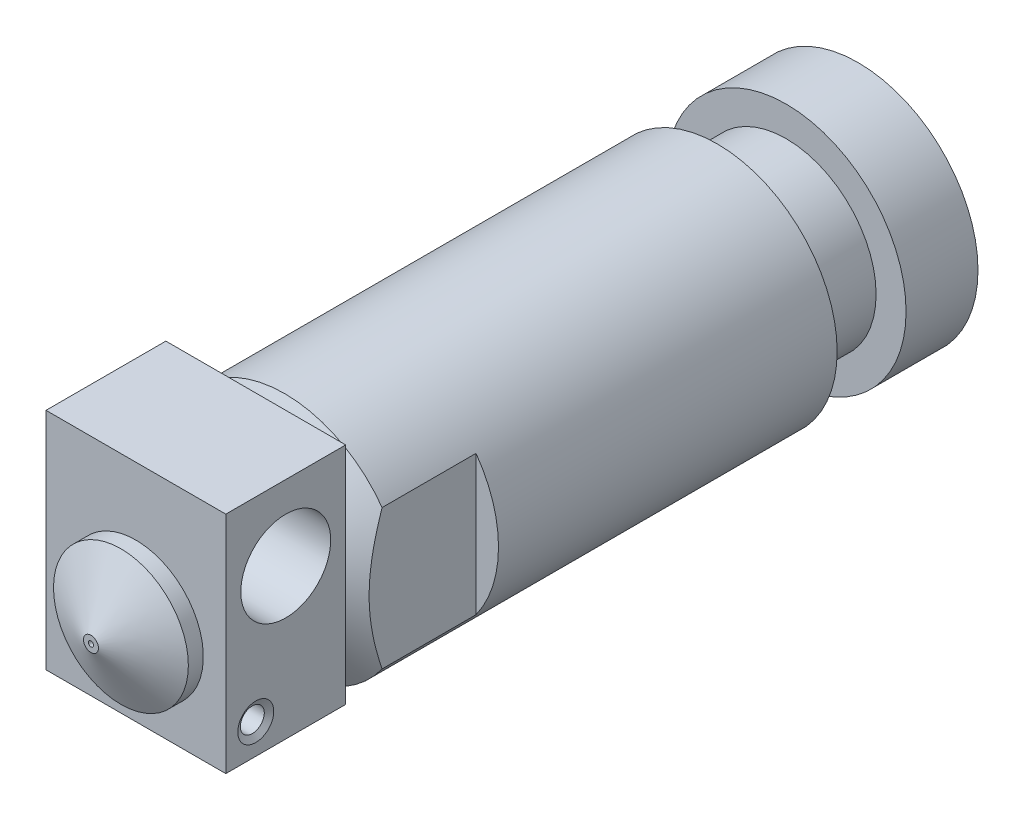
ISO-10303-21;
HEADER;
FILE_DESCRIPTION(('STEP AP214'),'2;1');
FILE_NAME('part.step','',(''),(''),'','','');
FILE_SCHEMA(('AUTOMOTIVE_DESIGN { 1 0 10303 214 1 1 1 1 }'));
ENDSEC;
DATA;
#1=APPLICATION_CONTEXT('core data for automotive mechanical design processes');
#2=APPLICATION_PROTOCOL_DEFINITION('international standard','automotive_design',2000,#1);
#3=PRODUCT_CONTEXT('',#1,'mechanical');
#4=PRODUCT('Part','Part','',(#3));
#5=PRODUCT_RELATED_PRODUCT_CATEGORY('part','',(#4));
#6=PRODUCT_DEFINITION_FORMATION('','',#4);
#7=PRODUCT_DEFINITION_CONTEXT('part definition',#1,'design');
#8=PRODUCT_DEFINITION('design','',#6,#7);
#9=PRODUCT_DEFINITION_SHAPE('','',#8);
#10=(LENGTH_UNIT() NAMED_UNIT(*) SI_UNIT(.MILLI.,.METRE.));
#11=(NAMED_UNIT(*) PLANE_ANGLE_UNIT() SI_UNIT($,.RADIAN.));
#12=(NAMED_UNIT(*) SI_UNIT($,.STERADIAN.) SOLID_ANGLE_UNIT());
#13=UNCERTAINTY_MEASURE_WITH_UNIT(LENGTH_MEASURE(1.E-05),#10,'distance_accuracy_value','');
#14=(GEOMETRIC_REPRESENTATION_CONTEXT(3) GLOBAL_UNCERTAINTY_ASSIGNED_CONTEXT((#13)) GLOBAL_UNIT_ASSIGNED_CONTEXT((#10,
#11,#12)) REPRESENTATION_CONTEXT('',''));
#15=CARTESIAN_POINT('',(0.,0.,0.));
#16=DIRECTION('',(0.,0.,1.));
#17=DIRECTION('',(1.,0.,0.));
#18=AXIS2_PLACEMENT_3D('',#15,#16,#17);
#19=CARTESIAN_POINT('',(0.,0.,48.2));
#20=DIRECTION('',(0.,0.,-1.));
#21=DIRECTION('',(-1.,0.,0.));
#22=AXIS2_PLACEMENT_3D('',#19,#20,#21);
#23=PLANE('',#22);
#24=DIRECTION('',(0.,1.,0.));
#25=VECTOR('',#24,1.);
#26=CARTESIAN_POINT('',(6.,9.,48.2));
#27=LINE('',#26,#25);
#28=CARTESIAN_POINT('',(6.,-6.,48.2));
#29=VERTEX_POINT('',#28);
#30=CARTESIAN_POINT('',(6.,9.,48.2));
#31=VERTEX_POINT('',#30);
#32=EDGE_CURVE('E116',#29,#31,#27,.T.);
#33=ORIENTED_EDGE('',*,*,#32,.T.);
#34=DIRECTION('',(-1.,0.,0.));
#35=VECTOR('',#34,1.);
#36=CARTESIAN_POINT('',(6.,9.,48.2));
#37=LINE('',#36,#35);
#38=CARTESIAN_POINT('',(-6.,9.,48.2));
#39=VERTEX_POINT('',#38);
#40=EDGE_CURVE('E105',#31,#39,#37,.T.);
#41=ORIENTED_EDGE('',*,*,#40,.T.);
#42=DIRECTION('',(0.,-1.,0.));
#43=VECTOR('',#42,1.);
#44=CARTESIAN_POINT('',(-6.,9.,48.2));
#45=LINE('',#44,#43);
#46=CARTESIAN_POINT('',(-6.,-6.,48.2));
#47=VERTEX_POINT('',#46);
#48=EDGE_CURVE('E115',#39,#47,#45,.T.);
#49=ORIENTED_EDGE('',*,*,#48,.T.);
#50=DIRECTION('',(1.,0.,0.));
#51=VECTOR('',#50,1.);
#52=CARTESIAN_POINT('',(6.,-6.,48.2));
#53=LINE('',#52,#51);
#54=EDGE_CURVE('E121',#47,#29,#53,.T.);
#55=ORIENTED_EDGE('',*,*,#54,.T.);
#56=EDGE_LOOP('',(#33,#41,#49,#55));
#57=FACE_BOUND('',#56,.T.);
#58=CARTESIAN_POINT('',(0.,0.,48.2));
#59=DIRECTION('',(0.,0.,-1.));
#60=DIRECTION('',(-1.,0.,0.));
#61=AXIS2_PLACEMENT_3D('',#58,#59,#60);
#62=CIRCLE('',#61,4.5);
#63=CARTESIAN_POINT('',(-4.5,0.,48.2));
#64=VERTEX_POINT('',#63);
#65=EDGE_CURVE('E316',#64,#64,#62,.F.);
#66=ORIENTED_EDGE('',*,*,#65,.F.);
#67=EDGE_LOOP('',(#66));
#68=FACE_BOUND('',#67,.T.);
#69=ADVANCED_FACE('F37',(#57,#68),#23,.F.);
#70=CARTESIAN_POINT('',(0.,0.,40.));
#71=DIRECTION('',(0.,0.,1.));
#72=DIRECTION('',(1.,0.,0.));
#73=AXIS2_PLACEMENT_3D('',#70,#71,#72);
#74=PLANE('',#73);
#75=CARTESIAN_POINT('',(0.,0.,40.));
#76=DIRECTION('',(0.,0.,1.));
#77=DIRECTION('',(1.,0.,0.));
#78=AXIS2_PLACEMENT_3D('',#75,#76,#77);
#79=CIRCLE('',#78,4.99999999999996);
#80=CARTESIAN_POINT('',(4.99999999999996,0.,40.));
#81=VERTEX_POINT('',#80);
#82=EDGE_CURVE('E176',#81,#81,#79,.T.);
#83=ORIENTED_EDGE('',*,*,#82,.T.);
#84=EDGE_LOOP('',(#83));
#85=FACE_BOUND('',#84,.T.);
#86=CARTESIAN_POINT('',(0.,0.,40.));
#87=DIRECTION('',(0.,0.,1.));
#88=DIRECTION('',(1.,0.,0.));
#89=AXIS2_PLACEMENT_3D('',#86,#87,#88);
#90=CIRCLE('',#89,4.);
#91=CARTESIAN_POINT('',(4.,0.,40.));
#92=VERTEX_POINT('',#91);
#93=EDGE_CURVE('E130',#92,#92,#90,.T.);
#94=ORIENTED_EDGE('',*,*,#93,.F.);
#95=EDGE_LOOP('',(#94));
#96=FACE_BOUND('',#95,.T.);
#97=ADVANCED_FACE('F217',(#85,#96),#74,.T.);
#98=CARTESIAN_POINT('',(0.,0.,40.));
#99=DIRECTION('',(0.,0.,-1.));
#100=DIRECTION('',(-1.,0.,0.));
#101=AXIS2_PLACEMENT_3D('',#98,#99,#100);
#102=CYLINDRICAL_SURFACE('',#101,8.);
#103=CARTESIAN_POINT('',(0.,0.,38.2679491924311));
#104=DIRECTION('',(0.,0.,1.));
#105=DIRECTION('',(1.,0.,0.));
#106=AXIS2_PLACEMENT_3D('',#103,#104,#105);
#107=CIRCLE('',#106,8.);
#108=CARTESIAN_POINT('',(-6.5,4.66368952654441,38.2679491924311));
#109=VERTEX_POINT('',#108);
#110=CARTESIAN_POINT('',(6.5,4.66368952654441,38.2679491924311));
#111=VERTEX_POINT('',#110);
#112=EDGE_CURVE('E179',#109,#111,#107,.F.);
#113=ORIENTED_EDGE('',*,*,#112,.T.);
#114=DIRECTION('',(0.,0.,-1.));
#115=VECTOR('',#114,1.);
#116=CARTESIAN_POINT('',(6.5,4.66368952654441,40.));
#117=LINE('',#116,#115);
#118=CARTESIAN_POINT('',(6.5,4.66368952654441,32.));
#119=VERTEX_POINT('',#118);
#120=EDGE_CURVE('E52',#111,#119,#117,.T.);
#121=ORIENTED_EDGE('',*,*,#120,.T.);
#122=CARTESIAN_POINT('',(0.,0.,32.));
#123=DIRECTION('',(0.,0.,-1.));
#124=DIRECTION('',(-1.,0.,0.));
#125=AXIS2_PLACEMENT_3D('',#122,#123,#124);
#126=CIRCLE('',#125,8.);
#127=CARTESIAN_POINT('',(6.5,-4.66368952654441,32.));
#128=VERTEX_POINT('',#127);
#129=EDGE_CURVE('E303',#119,#128,#126,.T.);
#130=ORIENTED_EDGE('',*,*,#129,.T.);
#131=DIRECTION('',(0.,0.,-1.));
#132=VECTOR('',#131,1.);
#133=CARTESIAN_POINT('',(6.5,-4.66368952654441,40.));
#134=LINE('',#133,#132);
#135=CARTESIAN_POINT('',(6.5,-4.66368952654441,38.2679491924311));
#136=VERTEX_POINT('',#135);
#137=EDGE_CURVE('E150',#128,#136,#134,.F.);
#138=ORIENTED_EDGE('',*,*,#137,.T.);
#139=CARTESIAN_POINT('',(-6.5,-4.66368952654441,38.2679491924311));
#140=VERTEX_POINT('',#139);
#141=EDGE_CURVE('E60',#136,#140,#107,.F.);
#142=ORIENTED_EDGE('',*,*,#141,.T.);
#143=DIRECTION('',(0.,0.,-1.));
#144=VECTOR('',#143,1.);
#145=CARTESIAN_POINT('',(-6.5,-4.66368952654441,40.));
#146=LINE('',#145,#144);
#147=CARTESIAN_POINT('',(-6.5,-4.66368952654441,32.));
#148=VERTEX_POINT('',#147);
#149=EDGE_CURVE('E159',#140,#148,#146,.T.);
#150=ORIENTED_EDGE('',*,*,#149,.T.);
#151=CARTESIAN_POINT('',(0.,0.,32.));
#152=DIRECTION('',(0.,0.,1.));
#153=DIRECTION('',(1.,0.,0.));
#154=AXIS2_PLACEMENT_3D('',#151,#152,#153);
#155=CIRCLE('',#154,8.);
#156=CARTESIAN_POINT('',(-6.5,4.66368952654441,32.));
#157=VERTEX_POINT('',#156);
#158=EDGE_CURVE('E189',#157,#148,#155,.T.);
#159=ORIENTED_EDGE('',*,*,#158,.F.);
#160=DIRECTION('',(0.,0.,-1.));
#161=VECTOR('',#160,1.);
#162=CARTESIAN_POINT('',(-6.5,4.66368952654441,40.));
#163=LINE('',#162,#161);
#164=EDGE_CURVE('E156',#157,#109,#163,.F.);
#165=ORIENTED_EDGE('',*,*,#164,.T.);
#166=EDGE_LOOP('',(#113,#121,#130,#138,#142,#150,#159,#165));
#167=FACE_BOUND('',#166,.T.);
#168=CARTESIAN_POINT('',(0.,0.,9.4));
#169=DIRECTION('',(0.,0.,-1.));
#170=DIRECTION('',(-1.,0.,0.));
#171=AXIS2_PLACEMENT_3D('',#168,#169,#170);
#172=CIRCLE('',#171,8.);
#173=CARTESIAN_POINT('',(-8.,0.,9.4));
#174=VERTEX_POINT('',#173);
#175=EDGE_CURVE('E168',#174,#174,#172,.T.);
#176=ORIENTED_EDGE('',*,*,#175,.F.);
#177=EDGE_LOOP('',(#176));
#178=FACE_BOUND('',#177,.T.);
#179=ADVANCED_FACE('F212',(#167,#178),#102,.T.);
#180=CARTESIAN_POINT('',(0.,0.,9.4));
#181=DIRECTION('',(0.,0.,-1.));
#182=DIRECTION('',(-1.,0.,0.));
#183=AXIS2_PLACEMENT_3D('',#180,#181,#182);
#184=PLANE('',#183);
#185=CARTESIAN_POINT('',(0.,0.,9.4));
#186=DIRECTION('',(0.,0.,-1.));
#187=DIRECTION('',(-1.,0.,0.));
#188=AXIS2_PLACEMENT_3D('',#185,#186,#187);
#189=CIRCLE('',#188,6.);
#190=CARTESIAN_POINT('',(-6.,0.,9.4));
#191=VERTEX_POINT('',#190);
#192=EDGE_CURVE('E162',#191,#191,#189,.T.);
#193=ORIENTED_EDGE('',*,*,#192,.F.);
#194=EDGE_LOOP('',(#193));
#195=FACE_BOUND('',#194,.T.);
#196=ORIENTED_EDGE('',*,*,#175,.T.);
#197=EDGE_LOOP('',(#196));
#198=FACE_BOUND('',#197,.T.);
#199=ADVANCED_FACE('F209',(#195,#198),#184,.T.);
#200=CARTESIAN_POINT('',(0.,0.,4.8));
#201=DIRECTION('',(0.,0.,-1.));
#202=DIRECTION('',(-1.,0.,0.));
#203=AXIS2_PLACEMENT_3D('',#200,#201,#202);
#204=PLANE('',#203);
#205=CARTESIAN_POINT('',(0.,0.,4.8));
#206=DIRECTION('',(0.,0.,-1.));
#207=DIRECTION('',(-1.,0.,0.));
#208=AXIS2_PLACEMENT_3D('',#205,#206,#207);
#209=CIRCLE('',#208,6.);
#210=CARTESIAN_POINT('',(-6.,0.,4.8));
#211=VERTEX_POINT('',#210);
#212=EDGE_CURVE('E161',#211,#211,#209,.T.);
#213=ORIENTED_EDGE('',*,*,#212,.T.);
#214=EDGE_LOOP('',(#213));
#215=FACE_BOUND('',#214,.T.);
#216=CARTESIAN_POINT('',(0.,0.,4.8));
#217=DIRECTION('',(0.,0.,-1.));
#218=DIRECTION('',(-1.,0.,0.));
#219=AXIS2_PLACEMENT_3D('',#216,#217,#218);
#220=CIRCLE('',#219,8.);
#221=CARTESIAN_POINT('',(-8.,0.,4.8));
#222=VERTEX_POINT('',#221);
#223=EDGE_CURVE('E165',#222,#222,#220,.T.);
#224=ORIENTED_EDGE('',*,*,#223,.F.);
#225=EDGE_LOOP('',(#224));
#226=FACE_BOUND('',#225,.T.);
#227=ADVANCED_FACE('F207',(#215,#226),#204,.F.);
#228=CARTESIAN_POINT('',(0.,0.,9.4));
#229=DIRECTION('',(0.,0.,-1.));
#230=DIRECTION('',(-1.,0.,0.));
#231=AXIS2_PLACEMENT_3D('',#228,#229,#230);
#232=CYLINDRICAL_SURFACE('',#231,6.);
#233=ORIENTED_EDGE('',*,*,#192,.T.);
#234=EDGE_LOOP('',(#233));
#235=FACE_BOUND('',#234,.T.);
#236=ORIENTED_EDGE('',*,*,#212,.F.);
#237=EDGE_LOOP('',(#236));
#238=FACE_BOUND('',#237,.T.);
#239=ADVANCED_FACE('F203',(#235,#238),#232,.T.);
#240=CARTESIAN_POINT('',(0.,0.,0.));
#241=DIRECTION('',(0.,0.,1.));
#242=DIRECTION('',(1.,0.,0.));
#243=AXIS2_PLACEMENT_3D('',#240,#241,#242);
#244=PLANE('',#243);
#245=CARTESIAN_POINT('',(0.,0.,0.));
#246=DIRECTION('',(0.,0.,-1.));
#247=DIRECTION('',(-1.,0.,0.));
#248=AXIS2_PLACEMENT_3D('',#245,#246,#247);
#249=CIRCLE('',#248,1.);
#250=CARTESIAN_POINT('',(-1.,0.,0.));
#251=VERTEX_POINT('',#250);
#252=EDGE_CURVE('E140',#251,#251,#249,.T.);
#253=ORIENTED_EDGE('',*,*,#252,.F.);
#254=EDGE_LOOP('',(#253));
#255=FACE_BOUND('',#254,.T.);
#256=CARTESIAN_POINT('',(0.,0.,0.));
#257=DIRECTION('',(0.,0.,1.));
#258=DIRECTION('',(1.,0.,0.));
#259=AXIS2_PLACEMENT_3D('',#256,#257,#258);
#260=CIRCLE('',#259,8.);
#261=CARTESIAN_POINT('',(8.,0.,0.));
#262=VERTEX_POINT('',#261);
#263=EDGE_CURVE('E171',#262,#262,#260,.T.);
#264=ORIENTED_EDGE('',*,*,#263,.F.);
#265=EDGE_LOOP('',(#264));
#266=FACE_BOUND('',#265,.T.);
#267=ADVANCED_FACE('F206',(#255,#266),#244,.F.);
#268=ORIENTED_EDGE('',*,*,#223,.T.);
#269=EDGE_LOOP('',(#268));
#270=FACE_BOUND('',#269,.T.);
#271=ORIENTED_EDGE('',*,*,#263,.T.);
#272=EDGE_LOOP('',(#271));
#273=FACE_BOUND('',#272,.T.);
#274=ADVANCED_FACE('F222',(#270,#273),#102,.T.);
#275=CARTESIAN_POINT('',(0.,0.,40.));
#276=DIRECTION('',(0.,0.,-1.));
#277=DIRECTION('',(-1.,0.,0.));
#278=AXIS2_PLACEMENT_3D('',#275,#276,#277);
#279=CONICAL_SURFACE('',#278,4.99999999999996,1.0471975511966);
#280=CARTESIAN_POINT('',(6.5,-11.9320806704207,35.041911234439));
#281=CARTESIAN_POINT('',(6.5,-11.6287541291297,35.1956703163111));
#282=CARTESIAN_POINT('',(6.5,-11.3249036511508,35.3484078110494));
#283=CARTESIAN_POINT('',(6.5,-10.7158810169491,35.6512871036295));
#284=CARTESIAN_POINT('',(6.5,-10.4107087523028,35.8014286832906));
#285=CARTESIAN_POINT('',(6.5,-9.79789077910119,36.0989886129877));
#286=CARTESIAN_POINT('',(6.5,-9.49024037449567,36.2463973141076));
#287=CARTESIAN_POINT('',(6.5,-8.87306606591167,36.5372244003522));
#288=CARTESIAN_POINT('',(6.5,-8.56354221657121,36.6806429011727));
#289=CARTESIAN_POINT('',(6.5,-7.92658275778894,36.9695472034622));
#290=CARTESIAN_POINT('',(6.5,-7.59902929296596,37.1147741443676));
#291=CARTESIAN_POINT('',(6.5,-6.94079913214904,37.3980800963094));
#292=CARTESIAN_POINT('',(6.5,-6.6101221904068,37.5361585392843));
#293=CARTESIAN_POINT('',(6.5,-5.94535111063429,37.8027876242295));
#294=CARTESIAN_POINT('',(6.5,-5.61126118892866,37.9313487070378));
#295=CARTESIAN_POINT('',(6.5,-4.93859687914826,38.1760705786222));
#296=CARTESIAN_POINT('',(6.5,-4.60002341371426,38.2922338754221));
#297=CARTESIAN_POINT('',(6.5,-3.92092344171232,38.5071109572557));
#298=CARTESIAN_POINT('',(6.5,-3.58044746107673,38.6059825816966));
#299=CARTESIAN_POINT('',(6.5,-2.89393613632542,38.7826598865593));
#300=CARTESIAN_POINT('',(6.5,-2.54790115437974,38.8604669334936));
#301=CARTESIAN_POINT('',(6.5,-2.02817909084592,38.9566465987215));
#302=CARTESIAN_POINT('',(6.5,-1.856341254406,38.9851214428116));
#303=CARTESIAN_POINT('',(6.5,-1.51165360989303,39.0350295136214));
#304=CARTESIAN_POINT('',(6.5,-1.33880392136544,39.0564635557457));
#305=CARTESIAN_POINT('',(6.5,-0.992331747480587,39.0917698840328));
#306=CARTESIAN_POINT('',(6.5,-0.818709275570337,39.105642301259));
#307=CARTESIAN_POINT('',(6.5,-0.471026797904922,39.1254598192205));
#308=CARTESIAN_POINT('',(6.5,-0.296966835087933,39.1314056696496));
#309=CARTESIAN_POINT('',(6.5,0.0763749722474343,39.1354769140002));
#310=CARTESIAN_POINT('',(6.5,0.275671773692866,39.132349932855));
#311=CARTESIAN_POINT('',(6.5,0.673823870223682,39.1156064449479));
#312=CARTESIAN_POINT('',(6.5,0.872679149209329,39.1019895617817));
#313=CARTESIAN_POINT('',(6.5,1.26948788307425,39.0647424710405));
#314=CARTESIAN_POINT('',(6.5,1.46744111336444,39.0411098942144));
#315=CARTESIAN_POINT('',(6.5,1.86201207037339,38.9845918515618));
#316=CARTESIAN_POINT('',(6.5,2.05862977639347,38.9517062426603));
#317=CARTESIAN_POINT('',(6.5,2.45504915908561,38.8767083106986));
#318=CARTESIAN_POINT('',(6.5,2.65481169551078,38.8343907074067));
#319=CARTESIAN_POINT('',(6.5,3.05254538174275,38.7420815301885));
#320=CARTESIAN_POINT('',(6.5,3.25051650097028,38.692089825527));
#321=CARTESIAN_POINT('',(6.5,3.64467689770064,38.585459084271));
#322=CARTESIAN_POINT('',(6.5,3.84086594007798,38.5288191838603));
#323=CARTESIAN_POINT('',(6.5,4.23148838415667,38.4098489627826));
#324=CARTESIAN_POINT('',(6.5,4.42592189396033,38.3475189951617));
#325=CARTESIAN_POINT('',(6.5,4.82390642026804,38.2144104411378));
#326=CARTESIAN_POINT('',(6.5,5.02736449186679,38.14335494058));
#327=CARTESIAN_POINT('',(6.5,5.43263072760185,37.9966731272807));
#328=CARTESIAN_POINT('',(6.5,5.63443880118571,37.921046565564));
#329=CARTESIAN_POINT('',(6.5,6.23773266502044,37.6883734796182));
#330=CARTESIAN_POINT('',(6.5,6.63699650265573,37.5255649203603));
#331=CARTESIAN_POINT('',(6.5,7.43122010062414,37.1887829100743));
#332=CARTESIAN_POINT('',(6.5,7.82617495178768,37.0147980213638));
#333=CARTESIAN_POINT('',(6.5,8.6123635639305,36.6587659858467));
#334=CARTESIAN_POINT('',(6.5,9.00359776049561,36.4767197972689));
#335=CARTESIAN_POINT('',(6.5,9.78466234180405,36.1058931412876));
#336=CARTESIAN_POINT('',(6.5,10.1744818326007,35.9170898226196));
#337=CARTESIAN_POINT('',(6.5,10.9518472275531,35.534846619276));
#338=CARTESIAN_POINT('',(6.5,11.3393930760744,35.3414066217281));
#339=CARTESIAN_POINT('',(6.5,12.1124401964901,34.9510486920648));
#340=CARTESIAN_POINT('',(6.5,12.4979425355,34.7541328692818));
#341=CARTESIAN_POINT('',(6.5,13.2674799769655,34.35746719772));
#342=CARTESIAN_POINT('',(6.5,13.6515150922768,34.1577173738453));
#343=CARTESIAN_POINT('',(6.5,14.6992224414959,33.6088414494328));
#344=CARTESIAN_POINT('',(6.5,15.3617100428348,33.2574551977549));
#345=CARTESIAN_POINT('',(6.5,16.6842507155655,32.5498794339776));
#346=CARTESIAN_POINT('',(6.5,17.3443033604084,32.1936891268765));
#347=CARTESIAN_POINT('',(6.5,18.657707350094,31.4804563180539));
#348=CARTESIAN_POINT('',(6.5,19.3110724171816,31.123439066178));
#349=CARTESIAN_POINT('',(6.5,20.2899989921032,30.5860206017485));
#350=CARTESIAN_POINT('',(6.5,20.6160901774981,30.4065827690121));
#351=CARTESIAN_POINT('',(6.5,21.2679596776015,30.0471408805074));
#352=CARTESIAN_POINT('',(6.5,21.5937379928118,29.8671368256492));
#353=CARTESIAN_POINT('',(6.5,21.919380431323,29.6868872242604));
#354=B_SPLINE_CURVE_WITH_KNOTS('',3,(#280,#281,#282,#283,#284,#285,#286,#287,#288,#289,#290,
#291,#292,#293,#294,#295,#296,#297,#298,#299,#300,#301,#302,#303,#304,#305,#306,#307,#308,#309,
#310,#311,#312,#313,#314,#315,#316,#317,#318,#319,#320,#321,#322,#323,#324,#325,#326,#327,#328,
#329,#330,#331,#332,#333,#334,#335,#336,#337,#338,#339,#340,#341,#342,#343,#344,#345,#346,#347,
#348,#349,#350,#351,#352,#353),.UNSPECIFIED.,.F.,.F.,(4,2,2,2,2,2,2,2,2,2,2,2,2,2,2,2,2,2,2,2,2,
2,2,2,2,2,2,2,2,2,2,2,2,2,2,2,4),(0.,1.02022163609096,2.04052860672414,3.06393246904831,
4.08730662679436,5.1621551858701,6.23708902799412,7.31082560104652,8.38434454800789,
9.44748504305788,10.510556552953,11.0329786065631,11.5553401364444,12.0776926121059,
12.5999956802215,13.1976712315445,13.7953682299819,14.39320669494,14.9910544044826,
15.6034682021252,16.2158924339445,16.8283963277933,17.4408622440131,18.0873230996148,
18.7338191982219,20.0271016299293,21.3217293487543,22.6162035889882,23.9155701782401,
25.2149684305998,26.5136035394173,27.812227243399,30.0619201367172,32.3119900045485,
34.5456167332077,35.6622185815921,36.7788186363861),.UNSPECIFIED.);
#355=EDGE_CURVE('E298',#111,#136,#354,.F.);
#356=ORIENTED_EDGE('',*,*,#355,.F.);
#357=ORIENTED_EDGE('',*,*,#112,.F.);
#358=CARTESIAN_POINT('',(-6.5,-11.9320806704208,35.041911234439));
#359=CARTESIAN_POINT('',(-6.5,-11.6287541291298,35.1956703163111));
#360=CARTESIAN_POINT('',(-6.5,-11.3249036511508,35.3484078110493));
#361=CARTESIAN_POINT('',(-6.5,-10.7158810169491,35.6512871036295));
#362=CARTESIAN_POINT('',(-6.5,-10.4107087523029,35.8014286832906));
#363=CARTESIAN_POINT('',(-6.5,-9.7978907791012,36.0989886129877));
#364=CARTESIAN_POINT('',(-6.5,-9.49024037449568,36.2463973141076));
#365=CARTESIAN_POINT('',(-6.5,-8.87306606591168,36.5372244003522));
#366=CARTESIAN_POINT('',(-6.5,-8.56354221657122,36.6806429011727));
#367=CARTESIAN_POINT('',(-6.5,-7.92658275778895,36.9695472034622));
#368=CARTESIAN_POINT('',(-6.5,-7.59902929296598,37.1147741443676));
#369=CARTESIAN_POINT('',(-6.5,-6.94079913214906,37.3980800963094));
#370=CARTESIAN_POINT('',(-6.5,-6.61012219040681,37.5361585392843));
#371=CARTESIAN_POINT('',(-6.5,-5.9453511106343,37.8027876242295));
#372=CARTESIAN_POINT('',(-6.5,-5.61126118892867,37.9313487070377));
#373=CARTESIAN_POINT('',(-6.5,-4.93859687914826,38.1760705786222));
#374=CARTESIAN_POINT('',(-6.5,-4.60002341371427,38.2922338754221));
#375=CARTESIAN_POINT('',(-6.5,-3.92092344171232,38.5071109572557));
#376=CARTESIAN_POINT('',(-6.5,-3.58044746107673,38.6059825816966));
#377=CARTESIAN_POINT('',(-6.5,-2.89393613632543,38.7826598865593));
#378=CARTESIAN_POINT('',(-6.5,-2.54790115437975,38.8604669334936));
#379=CARTESIAN_POINT('',(-6.5,-2.02817909084592,38.9566465987215));
#380=CARTESIAN_POINT('',(-6.5,-1.856341254406,38.9851214428116));
#381=CARTESIAN_POINT('',(-6.5,-1.51165360989303,39.0350295136214));
#382=CARTESIAN_POINT('',(-6.5,-1.33880392136543,39.0564635557457));
#383=CARTESIAN_POINT('',(-6.5,-0.992331747480586,39.0917698840328));
#384=CARTESIAN_POINT('',(-6.5,-0.818709275570336,39.105642301259));
#385=CARTESIAN_POINT('',(-6.5,-0.471026797904921,39.1254598192205));
#386=CARTESIAN_POINT('',(-6.5,-0.296966835087931,39.1314056696496));
#387=CARTESIAN_POINT('',(-6.5,0.0763749722474384,39.1354769140001));
#388=CARTESIAN_POINT('',(-6.5,0.275671773692871,39.132349932855));
#389=CARTESIAN_POINT('',(-6.5,0.673823870223688,39.1156064449479));
#390=CARTESIAN_POINT('',(-6.5,0.872679149209335,39.1019895617817));
#391=CARTESIAN_POINT('',(-6.5,1.26948788307425,39.0647424710405));
#392=CARTESIAN_POINT('',(-6.5,1.46744111336444,39.0411098942144));
#393=CARTESIAN_POINT('',(-6.5,1.8620120703734,38.9845918515618));
#394=CARTESIAN_POINT('',(-6.5,2.05862977639347,38.9517062426603));
#395=CARTESIAN_POINT('',(-6.5,2.45504915908562,38.8767083106986));
#396=CARTESIAN_POINT('',(-6.5,2.65481169551079,38.8343907074067));
#397=CARTESIAN_POINT('',(-6.5,3.05254538174275,38.7420815301885));
#398=CARTESIAN_POINT('',(-6.5,3.25051650097029,38.692089825527));
#399=CARTESIAN_POINT('',(-6.5,3.64467689770064,38.585459084271));
#400=CARTESIAN_POINT('',(-6.5,3.84086594007799,38.5288191838603));
#401=CARTESIAN_POINT('',(-6.5,4.23148838415667,38.4098489627826));
#402=CARTESIAN_POINT('',(-6.5,4.42592189396033,38.3475189951617));
#403=CARTESIAN_POINT('',(-6.5,4.82390642026805,38.2144104411378));
#404=CARTESIAN_POINT('',(-6.5,5.02736449186679,38.14335494058));
#405=CARTESIAN_POINT('',(-6.5,5.43263072760185,37.9966731272807));
#406=CARTESIAN_POINT('',(-6.5,5.63443880118572,37.921046565564));
#407=CARTESIAN_POINT('',(-6.5,6.23773266502045,37.6883734796183));
#408=CARTESIAN_POINT('',(-6.5,6.63699650265574,37.5255649203603));
#409=CARTESIAN_POINT('',(-6.5,7.43122010062415,37.1887829100742));
#410=CARTESIAN_POINT('',(-6.5,7.82617495178769,37.0147980213638));
#411=CARTESIAN_POINT('',(-6.5,8.61236356393051,36.6587659858467));
#412=CARTESIAN_POINT('',(-6.5,9.00359776049562,36.4767197972689));
#413=CARTESIAN_POINT('',(-6.5,9.78466234180406,36.1058931412876));
#414=CARTESIAN_POINT('',(-6.5,10.1744818326007,35.9170898226196));
#415=CARTESIAN_POINT('',(-6.5,10.9518472275532,35.534846619276));
#416=CARTESIAN_POINT('',(-6.5,11.3393930760744,35.3414066217281));
#417=CARTESIAN_POINT('',(-6.5,12.1124401964901,34.9510486920648));
#418=CARTESIAN_POINT('',(-6.5,12.4979425355,34.7541328692818));
#419=CARTESIAN_POINT('',(-6.5,13.2674799769655,34.35746719772));
#420=CARTESIAN_POINT('',(-6.5,13.6515150922769,34.1577173738453));
#421=CARTESIAN_POINT('',(-6.5,14.699222441496,33.6088414494328));
#422=CARTESIAN_POINT('',(-6.5,15.3617100428348,33.2574551977548));
#423=CARTESIAN_POINT('',(-6.5,16.6842507155655,32.5498794339776));
#424=CARTESIAN_POINT('',(-6.5,17.3443033604084,32.1936891268764));
#425=CARTESIAN_POINT('',(-6.5,18.657707350094,31.4804563180539));
#426=CARTESIAN_POINT('',(-6.5,19.3110724171816,31.123439066178));
#427=CARTESIAN_POINT('',(-6.5,20.2899989921032,30.5860206017485));
#428=CARTESIAN_POINT('',(-6.5,20.6160901774981,30.4065827690121));
#429=CARTESIAN_POINT('',(-6.5,21.2679596776016,30.0471408805074));
#430=CARTESIAN_POINT('',(-6.5,21.5937379928118,29.8671368256492));
#431=CARTESIAN_POINT('',(-6.5,21.919380431323,29.6868872242604));
#432=B_SPLINE_CURVE_WITH_KNOTS('',3,(#358,#359,#360,#361,#362,#363,#364,#365,#366,#367,#368,
#369,#370,#371,#372,#373,#374,#375,#376,#377,#378,#379,#380,#381,#382,#383,#384,#385,#386,#387,
#388,#389,#390,#391,#392,#393,#394,#395,#396,#397,#398,#399,#400,#401,#402,#403,#404,#405,#406,
#407,#408,#409,#410,#411,#412,#413,#414,#415,#416,#417,#418,#419,#420,#421,#422,#423,#424,#425,
#426,#427,#428,#429,#430,#431),.UNSPECIFIED.,.F.,.F.,(4,2,2,2,2,2,2,2,2,2,2,2,2,2,2,2,2,2,2,2,2,
2,2,2,2,2,2,2,2,2,2,2,2,2,2,2,4),(0.,1.02022163609097,2.04052860672415,3.06393246904831,
4.08730662679437,5.1621551858701,6.23708902799412,7.31082560104653,8.3843445480079,
9.44748504305789,10.5105565529531,11.0329786065632,11.5553401364444,12.0776926121059,
12.5999956802216,13.1976712315445,13.7953682299819,14.3932066949401,14.9910544044826,
15.6034682021252,16.2158924339445,16.8283963277934,17.4408622440131,18.0873230996149,
18.733819198222,20.0271016299293,21.3217293487543,22.6162035889882,23.9155701782401,
25.2149684305998,26.5136035394173,27.8122272433991,30.0619201367173,32.3119900045486,
34.5456167332077,35.6622185815922,36.7788186363861),.UNSPECIFIED.);
#433=EDGE_CURVE('E182',#140,#109,#432,.T.);
#434=ORIENTED_EDGE('',*,*,#433,.F.);
#435=ORIENTED_EDGE('',*,*,#141,.F.);
#436=EDGE_LOOP('',(#356,#357,#434,#435));
#437=FACE_BOUND('',#436,.T.);
#438=ORIENTED_EDGE('',*,*,#82,.F.);
#439=EDGE_LOOP('',(#438));
#440=FACE_BOUND('',#439,.T.);
#441=ADVANCED_FACE('F191',(#437,#440),#279,.T.);
#442=CARTESIAN_POINT('',(0.,0.,32.));
#443=DIRECTION('',(0.,0.,1.));
#444=DIRECTION('',(1.,0.,0.));
#445=AXIS2_PLACEMENT_3D('',#442,#443,#444);
#446=PLANE('',#445);
#447=ORIENTED_EDGE('',*,*,#158,.T.);
#448=DIRECTION('',(0.,1.,0.));
#449=VECTOR('',#448,1.);
#450=CARTESIAN_POINT('',(-6.5,6.,32.));
#451=LINE('',#450,#449);
#452=EDGE_CURVE('E153',#148,#157,#451,.T.);
#453=ORIENTED_EDGE('',*,*,#452,.T.);
#454=EDGE_LOOP('',(#447,#453));
#455=FACE_BOUND('',#454,.T.);
#456=ADVANCED_FACE('F200',(#455),#446,.T.);
#457=CARTESIAN_POINT('',(-6.5,6.,32.));
#458=DIRECTION('',(1.,0.,0.));
#459=DIRECTION('',(0.,1.,0.));
#460=AXIS2_PLACEMENT_3D('',#457,#458,#459);
#461=PLANE('',#460);
#462=ORIENTED_EDGE('',*,*,#433,.T.);
#463=ORIENTED_EDGE('',*,*,#164,.F.);
#464=ORIENTED_EDGE('',*,*,#452,.F.);
#465=ORIENTED_EDGE('',*,*,#149,.F.);
#466=EDGE_LOOP('',(#462,#463,#464,#465));
#467=FACE_BOUND('',#466,.T.);
#468=ADVANCED_FACE('F194',(#467),#461,.F.);
#469=CARTESIAN_POINT('',(0.,0.,32.));
#470=DIRECTION('',(0.,0.,-1.));
#471=DIRECTION('',(-1.,0.,0.));
#472=AXIS2_PLACEMENT_3D('',#469,#470,#471);
#473=PLANE('',#472);
#474=DIRECTION('',(0.,-1.,0.));
#475=VECTOR('',#474,1.);
#476=CARTESIAN_POINT('',(6.5,6.,32.));
#477=LINE('',#476,#475);
#478=EDGE_CURVE('E145',#119,#128,#477,.T.);
#479=ORIENTED_EDGE('',*,*,#478,.T.);
#480=ORIENTED_EDGE('',*,*,#129,.F.);
#481=EDGE_LOOP('',(#479,#480));
#482=FACE_BOUND('',#481,.T.);
#483=ADVANCED_FACE('F199',(#482),#473,.F.);
#484=CARTESIAN_POINT('',(6.5,6.,32.));
#485=DIRECTION('',(-1.,0.,0.));
#486=DIRECTION('',(0.,0.,1.));
#487=AXIS2_PLACEMENT_3D('',#484,#485,#486);
#488=PLANE('',#487);
#489=ORIENTED_EDGE('',*,*,#355,.T.);
#490=ORIENTED_EDGE('',*,*,#137,.F.);
#491=ORIENTED_EDGE('',*,*,#478,.F.);
#492=ORIENTED_EDGE('',*,*,#120,.F.);
#493=EDGE_LOOP('',(#489,#490,#491,#492));
#494=FACE_BOUND('',#493,.T.);
#495=ADVANCED_FACE('F268',(#494),#488,.F.);
#496=CARTESIAN_POINT('',(0.,0.,40.));
#497=DIRECTION('',(0.,0.,-1.));
#498=DIRECTION('',(-1.,0.,0.));
#499=AXIS2_PLACEMENT_3D('',#496,#497,#498);
#500=CYLINDRICAL_SURFACE('',#499,1.);
#501=CARTESIAN_POINT('',(0.,0.,40.));
#502=DIRECTION('',(0.,0.,-1.));
#503=DIRECTION('',(-1.,0.,0.));
#504=AXIS2_PLACEMENT_3D('',#501,#502,#503);
#505=CIRCLE('',#504,1.);
#506=CARTESIAN_POINT('',(-1.,0.,40.));
#507=VERTEX_POINT('',#506);
#508=EDGE_CURVE('E142',#507,#507,#505,.T.);
#509=ORIENTED_EDGE('',*,*,#508,.F.);
#510=EDGE_LOOP('',(#509));
#511=FACE_BOUND('',#510,.T.);
#512=ORIENTED_EDGE('',*,*,#252,.T.);
#513=EDGE_LOOP('',(#512));
#514=FACE_BOUND('',#513,.T.);
#515=ADVANCED_FACE('F261',(#511,#514),#500,.F.);
#516=CARTESIAN_POINT('',(0.,0.,40.));
#517=DIRECTION('',(0.,0.,1.));
#518=DIRECTION('',(1.,0.,0.));
#519=AXIS2_PLACEMENT_3D('',#516,#517,#518);
#520=PLANE('',#519);
#521=CARTESIAN_POINT('',(0.,0.,40.));
#522=DIRECTION('',(0.,0.,1.));
#523=DIRECTION('',(1.,0.,0.));
#524=AXIS2_PLACEMENT_3D('',#521,#522,#523);
#525=CIRCLE('',#524,0.175);
#526=CARTESIAN_POINT('',(0.175,0.,40.));
#527=VERTEX_POINT('',#526);
#528=EDGE_CURVE('E362',#527,#527,#525,.T.);
#529=ORIENTED_EDGE('',*,*,#528,.T.);
#530=EDGE_LOOP('',(#529));
#531=FACE_BOUND('',#530,.T.);
#532=ORIENTED_EDGE('',*,*,#508,.T.);
#533=EDGE_LOOP('',(#532));
#534=FACE_BOUND('',#533,.T.);
#535=ADVANCED_FACE('F258',(#531,#534),#520,.F.);
#536=CARTESIAN_POINT('',(0.,0.,40.2));
#537=DIRECTION('',(0.,0.,-1.));
#538=DIRECTION('',(-1.,0.,0.));
#539=AXIS2_PLACEMENT_3D('',#536,#537,#538);
#540=CYLINDRICAL_SURFACE('',#539,4.);
#541=CARTESIAN_POINT('',(0.,0.,40.2));
#542=DIRECTION('',(0.,0.,1.));
#543=DIRECTION('',(1.,0.,0.));
#544=AXIS2_PLACEMENT_3D('',#541,#542,#543);
#545=CIRCLE('',#544,4.);
#546=CARTESIAN_POINT('',(4.,0.,40.2));
#547=VERTEX_POINT('',#546);
#548=EDGE_CURVE('E133',#547,#547,#545,.T.);
#549=ORIENTED_EDGE('',*,*,#548,.F.);
#550=EDGE_LOOP('',(#549));
#551=FACE_BOUND('',#550,.T.);
#552=ORIENTED_EDGE('',*,*,#93,.T.);
#553=EDGE_LOOP('',(#552));
#554=FACE_BOUND('',#553,.T.);
#555=ADVANCED_FACE('F243',(#551,#554),#540,.T.);
#556=CARTESIAN_POINT('',(0.,0.,40.2));
#557=DIRECTION('',(0.,0.,-1.));
#558=DIRECTION('',(-1.,0.,0.));
#559=AXIS2_PLACEMENT_3D('',#556,#557,#558);
#560=PLANE('',#559);
#561=DIRECTION('',(0.,1.,0.));
#562=VECTOR('',#561,1.);
#563=CARTESIAN_POINT('',(6.,9.,40.2));
#564=LINE('',#563,#562);
#565=CARTESIAN_POINT('',(6.,-6.,40.2));
#566=VERTEX_POINT('',#565);
#567=CARTESIAN_POINT('',(6.,9.,40.2));
#568=VERTEX_POINT('',#567);
#569=EDGE_CURVE('E129',#566,#568,#564,.T.);
#570=ORIENTED_EDGE('',*,*,#569,.F.);
#571=DIRECTION('',(1.,0.,0.));
#572=VECTOR('',#571,1.);
#573=CARTESIAN_POINT('',(6.,-6.,40.2));
#574=LINE('',#573,#572);
#575=CARTESIAN_POINT('',(-6.,-6.,40.2));
#576=VERTEX_POINT('',#575);
#577=EDGE_CURVE('E125',#576,#566,#574,.T.);
#578=ORIENTED_EDGE('',*,*,#577,.F.);
#579=DIRECTION('',(0.,-1.,0.));
#580=VECTOR('',#579,1.);
#581=CARTESIAN_POINT('',(-6.,9.,40.2));
#582=LINE('',#581,#580);
#583=CARTESIAN_POINT('',(-6.,9.,40.2));
#584=VERTEX_POINT('',#583);
#585=EDGE_CURVE('E377',#584,#576,#582,.T.);
#586=ORIENTED_EDGE('',*,*,#585,.F.);
#587=DIRECTION('',(-1.,0.,0.));
#588=VECTOR('',#587,1.);
#589=CARTESIAN_POINT('',(6.,9.,40.2));
#590=LINE('',#589,#588);
#591=EDGE_CURVE('E375',#568,#584,#590,.T.);
#592=ORIENTED_EDGE('',*,*,#591,.F.);
#593=EDGE_LOOP('',(#570,#578,#586,#592));
#594=FACE_BOUND('',#593,.T.);
#595=ORIENTED_EDGE('',*,*,#548,.T.);
#596=EDGE_LOOP('',(#595));
#597=FACE_BOUND('',#596,.T.);
#598=ADVANCED_FACE('F240',(#594,#597),#560,.T.);
#599=CARTESIAN_POINT('',(6.,9.,48.2));
#600=DIRECTION('',(-1.,0.,0.));
#601=DIRECTION('',(0.,-1.,0.));
#602=AXIS2_PLACEMENT_3D('',#599,#600,#601);
#603=PLANE('',#602);
#604=CARTESIAN_POINT('',(6.,-4.,46.2));
#605=DIRECTION('',(-1.,0.,0.));
#606=DIRECTION('',(0.,-1.,0.));
#607=AXIS2_PLACEMENT_3D('',#604,#605,#606);
#608=CIRCLE('',#607,1.2);
#609=CARTESIAN_POINT('',(6.,-5.2,46.2));
#610=VERTEX_POINT('',#609);
#611=EDGE_CURVE('E313',#610,#610,#608,.T.);
#612=ORIENTED_EDGE('',*,*,#611,.T.);
#613=EDGE_LOOP('',(#612));
#614=FACE_BOUND('',#613,.T.);
#615=CARTESIAN_POINT('',(6.,4.,44.2));
#616=DIRECTION('',(1.,0.,0.));
#617=DIRECTION('',(0.,1.,0.));
#618=AXIS2_PLACEMENT_3D('',#615,#616,#617);
#619=CIRCLE('',#618,3.);
#620=CARTESIAN_POINT('',(6.,7.,44.2));
#621=VERTEX_POINT('',#620);
#622=EDGE_CURVE('E310',#621,#621,#619,.T.);
#623=ORIENTED_EDGE('',*,*,#622,.F.);
#624=EDGE_LOOP('',(#623));
#625=FACE_BOUND('',#624,.T.);
#626=ORIENTED_EDGE('',*,*,#569,.T.);
#627=DIRECTION('',(0.,0.,-1.));
#628=VECTOR('',#627,1.);
#629=CARTESIAN_POINT('',(6.,9.,48.2));
#630=LINE('',#629,#628);
#631=EDGE_CURVE('E109',#31,#568,#630,.T.);
#632=ORIENTED_EDGE('',*,*,#631,.F.);
#633=ORIENTED_EDGE('',*,*,#32,.F.);
#634=DIRECTION('',(0.,0.,-1.));
#635=VECTOR('',#634,1.);
#636=CARTESIAN_POINT('',(6.,-6.,48.2));
#637=LINE('',#636,#635);
#638=EDGE_CURVE('E373',#29,#566,#637,.T.);
#639=ORIENTED_EDGE('',*,*,#638,.T.);
#640=EDGE_LOOP('',(#626,#632,#633,#639));
#641=FACE_BOUND('',#640,.T.);
#642=ADVANCED_FACE('F127',(#614,#625,#641),#603,.F.);
#643=CARTESIAN_POINT('',(6.,9.,48.2));
#644=DIRECTION('',(0.,-1.,0.));
#645=DIRECTION('',(1.,0.,0.));
#646=AXIS2_PLACEMENT_3D('',#643,#644,#645);
#647=PLANE('',#646);
#648=ORIENTED_EDGE('',*,*,#591,.T.);
#649=DIRECTION('',(0.,0.,-1.));
#650=VECTOR('',#649,1.);
#651=CARTESIAN_POINT('',(-6.,9.,48.2));
#652=LINE('',#651,#650);
#653=EDGE_CURVE('E112',#39,#584,#652,.T.);
#654=ORIENTED_EDGE('',*,*,#653,.F.);
#655=ORIENTED_EDGE('',*,*,#40,.F.);
#656=ORIENTED_EDGE('',*,*,#631,.T.);
#657=EDGE_LOOP('',(#648,#654,#655,#656));
#658=FACE_BOUND('',#657,.T.);
#659=ADVANCED_FACE('F107',(#658),#647,.F.);
#660=CARTESIAN_POINT('',(-6.,9.,48.2));
#661=DIRECTION('',(1.,0.,0.));
#662=DIRECTION('',(0.,1.,0.));
#663=AXIS2_PLACEMENT_3D('',#660,#661,#662);
#664=PLANE('',#663);
#665=CARTESIAN_POINT('',(-6.,4.,44.2));
#666=DIRECTION('',(1.,0.,0.));
#667=DIRECTION('',(0.,1.,0.));
#668=AXIS2_PLACEMENT_3D('',#665,#666,#667);
#669=CIRCLE('',#668,3.);
#670=CARTESIAN_POINT('',(-6.,7.,44.2));
#671=VERTEX_POINT('',#670);
#672=EDGE_CURVE('E307',#671,#671,#669,.T.);
#673=ORIENTED_EDGE('',*,*,#672,.T.);
#674=EDGE_LOOP('',(#673));
#675=FACE_BOUND('',#674,.T.);
#676=ORIENTED_EDGE('',*,*,#585,.T.);
#677=DIRECTION('',(0.,0.,-1.));
#678=VECTOR('',#677,1.);
#679=CARTESIAN_POINT('',(-6.,-6.,48.2));
#680=LINE('',#679,#678);
#681=EDGE_CURVE('E135',#47,#576,#680,.T.);
#682=ORIENTED_EDGE('',*,*,#681,.F.);
#683=ORIENTED_EDGE('',*,*,#48,.F.);
#684=ORIENTED_EDGE('',*,*,#653,.T.);
#685=EDGE_LOOP('',(#676,#682,#683,#684));
#686=FACE_BOUND('',#685,.T.);
#687=ADVANCED_FACE('F248',(#675,#686),#664,.F.);
#688=CARTESIAN_POINT('',(6.,-6.,48.2));
#689=DIRECTION('',(0.,1.,0.));
#690=DIRECTION('',(-1.,0.,0.));
#691=AXIS2_PLACEMENT_3D('',#688,#689,#690);
#692=PLANE('',#691);
#693=ORIENTED_EDGE('',*,*,#577,.T.);
#694=ORIENTED_EDGE('',*,*,#638,.F.);
#695=ORIENTED_EDGE('',*,*,#54,.F.);
#696=ORIENTED_EDGE('',*,*,#681,.T.);
#697=EDGE_LOOP('',(#693,#694,#695,#696));
#698=FACE_BOUND('',#697,.T.);
#699=ADVANCED_FACE('F245',(#698),#692,.F.);
#700=CARTESIAN_POINT('',(-8.,4.,44.2));
#701=DIRECTION('',(1.,0.,0.));
#702=DIRECTION('',(0.,1.,0.));
#703=AXIS2_PLACEMENT_3D('',#700,#701,#702);
#704=CYLINDRICAL_SURFACE('',#703,3.);
#705=ORIENTED_EDGE('',*,*,#622,.T.);
#706=EDGE_LOOP('',(#705));
#707=FACE_BOUND('',#706,.T.);
#708=ORIENTED_EDGE('',*,*,#672,.F.);
#709=EDGE_LOOP('',(#708));
#710=FACE_BOUND('',#709,.T.);
#711=ADVANCED_FACE('F238',(#707,#710),#704,.F.);
#712=CARTESIAN_POINT('',(3.,-4.,46.2));
#713=DIRECTION('',(1.,0.,0.));
#714=DIRECTION('',(0.,1.,0.));
#715=AXIS2_PLACEMENT_3D('',#712,#713,#714);
#716=CYLINDRICAL_SURFACE('',#715,0.800000000000003);
#717=CARTESIAN_POINT('',(5.76905989232416,-4.,46.2));
#718=DIRECTION('',(-1.,0.,0.));
#719=DIRECTION('',(0.,0.,1.));
#720=AXIS2_PLACEMENT_3D('',#717,#718,#719);
#721=CIRCLE('',#720,0.800000000000003);
#722=CARTESIAN_POINT('',(5.76905989232416,-4.,47.));
#723=VERTEX_POINT('',#722);
#724=EDGE_CURVE('E306',#723,#723,#721,.F.);
#725=ORIENTED_EDGE('',*,*,#724,.T.);
#726=EDGE_LOOP('',(#725));
#727=FACE_BOUND('',#726,.T.);
#728=CARTESIAN_POINT('',(3.,-4.,46.2));
#729=DIRECTION('',(1.,0.,0.));
#730=DIRECTION('',(0.,1.,0.));
#731=AXIS2_PLACEMENT_3D('',#728,#729,#730);
#732=CIRCLE('',#731,0.800000000000003);
#733=CARTESIAN_POINT('',(3.,-3.2,46.2));
#734=VERTEX_POINT('',#733);
#735=EDGE_CURVE('E361',#734,#734,#732,.T.);
#736=ORIENTED_EDGE('',*,*,#735,.F.);
#737=EDGE_LOOP('',(#736));
#738=FACE_BOUND('',#737,.T.);
#739=ADVANCED_FACE('F349',(#727,#738),#716,.F.);
#740=CARTESIAN_POINT('',(3.,-4.,46.2));
#741=DIRECTION('',(1.,0.,0.));
#742=DIRECTION('',(0.,1.,0.));
#743=AXIS2_PLACEMENT_3D('',#740,#741,#742);
#744=PLANE('',#743);
#745=ORIENTED_EDGE('',*,*,#735,.T.);
#746=EDGE_LOOP('',(#745));
#747=FACE_BOUND('',#746,.T.);
#748=ADVANCED_FACE('F345',(#747),#744,.T.);
#749=CARTESIAN_POINT('',(5.76905989232416,-4.,46.2));
#750=DIRECTION('',(1.,0.,0.));
#751=DIRECTION('',(0.,0.,-1.));
#752=AXIS2_PLACEMENT_3D('',#749,#750,#751);
#753=CONICAL_SURFACE('',#752,0.800000000000003,1.04719755119661);
#754=ORIENTED_EDGE('',*,*,#611,.F.);
#755=EDGE_LOOP('',(#754));
#756=FACE_BOUND('',#755,.T.);
#757=ORIENTED_EDGE('',*,*,#724,.F.);
#758=EDGE_LOOP('',(#757));
#759=FACE_BOUND('',#758,.T.);
#760=ADVANCED_FACE('F339',(#756,#759),#753,.F.);
#761=CARTESIAN_POINT('',(0.,0.,49.2));
#762=DIRECTION('',(0.,0.,-1.));
#763=DIRECTION('',(-1.,0.,0.));
#764=AXIS2_PLACEMENT_3D('',#761,#762,#763);
#765=CYLINDRICAL_SURFACE('',#764,4.5);
#766=CARTESIAN_POINT('',(0.,0.,49.2));
#767=DIRECTION('',(0.,0.,1.));
#768=DIRECTION('',(1.,0.,0.));
#769=AXIS2_PLACEMENT_3D('',#766,#767,#768);
#770=CIRCLE('',#769,4.5);
#771=CARTESIAN_POINT('',(4.5,0.,49.2));
#772=VERTEX_POINT('',#771);
#773=EDGE_CURVE('E11',#772,#772,#770,.F.);
#774=ORIENTED_EDGE('',*,*,#773,.T.);
#775=EDGE_LOOP('',(#774));
#776=FACE_BOUND('',#775,.T.);
#777=ORIENTED_EDGE('',*,*,#65,.T.);
#778=EDGE_LOOP('',(#777));
#779=FACE_BOUND('',#778,.T.);
#780=ADVANCED_FACE('F332',(#776,#779),#765,.T.);
#781=CARTESIAN_POINT('',(0.,0.,51.2));
#782=DIRECTION('',(0.,0.,1.));
#783=DIRECTION('',(1.,0.,0.));
#784=AXIS2_PLACEMENT_3D('',#781,#782,#783);
#785=PLANE('',#784);
#786=CARTESIAN_POINT('',(0.,0.,51.2));
#787=DIRECTION('',(0.,0.,1.));
#788=DIRECTION('',(1.,0.,0.));
#789=AXIS2_PLACEMENT_3D('',#786,#787,#788);
#790=CIRCLE('',#789,0.175);
#791=CARTESIAN_POINT('',(0.175,0.,51.2));
#792=VERTEX_POINT('',#791);
#793=EDGE_CURVE('E367',#792,#792,#790,.T.);
#794=ORIENTED_EDGE('',*,*,#793,.F.);
#795=EDGE_LOOP('',(#794));
#796=FACE_BOUND('',#795,.T.);
#797=CARTESIAN_POINT('',(0.,0.,51.2));
#798=DIRECTION('',(0.,0.,1.));
#799=DIRECTION('',(1.,0.,0.));
#800=AXIS2_PLACEMENT_3D('',#797,#798,#799);
#801=CIRCLE('',#800,0.499999999999966);
#802=CARTESIAN_POINT('',(0.499999999999966,0.,51.2));
#803=VERTEX_POINT('',#802);
#804=EDGE_CURVE('E45',#803,#803,#801,.T.);
#805=ORIENTED_EDGE('',*,*,#804,.T.);
#806=EDGE_LOOP('',(#805));
#807=FACE_BOUND('',#806,.T.);
#808=ADVANCED_FACE('F321',(#796,#807),#785,.T.);
#809=CARTESIAN_POINT('',(0.,0.,51.2));
#810=DIRECTION('',(0.,0.,-1.));
#811=DIRECTION('',(-1.,0.,0.));
#812=AXIS2_PLACEMENT_3D('',#809,#810,#811);
#813=CONICAL_SURFACE('',#812,0.499999999999966,1.10714871779409);
#814=ORIENTED_EDGE('',*,*,#773,.F.);
#815=EDGE_LOOP('',(#814));
#816=FACE_BOUND('',#815,.T.);
#817=ORIENTED_EDGE('',*,*,#804,.F.);
#818=EDGE_LOOP('',(#817));
#819=FACE_BOUND('',#818,.T.);
#820=ADVANCED_FACE('F39',(#816,#819),#813,.T.);
#821=CARTESIAN_POINT('',(0.,0.,0.));
#822=DIRECTION('',(0.,0.,1.));
#823=DIRECTION('',(1.,0.,0.));
#824=AXIS2_PLACEMENT_3D('',#821,#822,#823);
#825=CYLINDRICAL_SURFACE('',#824,0.175);
#826=ORIENTED_EDGE('',*,*,#793,.T.);
#827=EDGE_LOOP('',(#826));
#828=FACE_BOUND('',#827,.T.);
#829=ORIENTED_EDGE('',*,*,#528,.F.);
#830=EDGE_LOOP('',(#829));
#831=FACE_BOUND('',#830,.T.);
#832=ADVANCED_FACE('F324',(#828,#831),#825,.F.);
#833=CLOSED_SHELL('',(#69,#97,#179,#199,#227,#239,#267,#274,#441,#456,#468,#483,#495,#515,#535,
#555,#598,#642,#659,#687,#699,#711,#739,#748,#760,#780,#808,#820,#832));
#834=CARTESIAN_POINT('',(0.,0.,26.5));
#835=DIRECTION('',(0.,0.,-1.));
#836=DIRECTION('',(-1.,0.,0.));
#837=AXIS2_PLACEMENT_3D('',#834,#835,#836);
#838=TOROIDAL_SURFACE('',#837,5.,1.);
#839=CARTESIAN_POINT('',(-6.,0.,26.5));
#840=VERTEX_POINT('',#839);
#841=VERTEX_LOOP('',#840);
#842=FACE_BOUND('',#841,.T.);
#843=ADVANCED_FACE('F290',(#842),#838,.F.);
#844=CLOSED_SHELL('',(#843));
#845=CARTESIAN_POINT('',(0.,0.,23.5));
#846=DIRECTION('',(0.,0.,-1.));
#847=DIRECTION('',(-1.,0.,0.));
#848=AXIS2_PLACEMENT_3D('',#845,#846,#847);
#849=TOROIDAL_SURFACE('',#848,5.,1.);
#850=CARTESIAN_POINT('',(-6.,0.,23.5));
#851=VERTEX_POINT('',#850);
#852=VERTEX_LOOP('',#851);
#853=FACE_BOUND('',#852,.T.);
#854=ADVANCED_FACE('F285',(#853),#849,.F.);
#855=CLOSED_SHELL('',(#854));
#856=CARTESIAN_POINT('',(0.,0.,20.5));
#857=DIRECTION('',(0.,0.,-1.));
#858=DIRECTION('',(-1.,0.,0.));
#859=AXIS2_PLACEMENT_3D('',#856,#857,#858);
#860=TOROIDAL_SURFACE('',#859,5.,1.);
#861=CARTESIAN_POINT('',(-6.,0.,20.5));
#862=VERTEX_POINT('',#861);
#863=VERTEX_LOOP('',#862);
#864=FACE_BOUND('',#863,.T.);
#865=ADVANCED_FACE('F280',(#864),#860,.F.);
#866=CLOSED_SHELL('',(#865));
#867=CARTESIAN_POINT('',(0.,0.,17.5));
#868=DIRECTION('',(0.,0.,-1.));
#869=DIRECTION('',(-1.,0.,0.));
#870=AXIS2_PLACEMENT_3D('',#867,#868,#869);
#871=TOROIDAL_SURFACE('',#870,5.,1.);
#872=CARTESIAN_POINT('',(-6.,0.,17.5));
#873=VERTEX_POINT('',#872);
#874=VERTEX_LOOP('',#873);
#875=FACE_BOUND('',#874,.T.);
#876=ADVANCED_FACE('F275',(#875),#871,.F.);
#877=CLOSED_SHELL('',(#876));
#878=CARTESIAN_POINT('',(0.,0.,14.5));
#879=DIRECTION('',(0.,0.,-1.));
#880=DIRECTION('',(-1.,0.,0.));
#881=AXIS2_PLACEMENT_3D('',#878,#879,#880);
#882=TOROIDAL_SURFACE('',#881,5.,1.);
#883=CARTESIAN_POINT('',(-6.,0.,14.5));
#884=VERTEX_POINT('',#883);
#885=VERTEX_LOOP('',#884);
#886=FACE_BOUND('',#885,.T.);
#887=ADVANCED_FACE('F270',(#886),#882,.F.);
#888=CLOSED_SHELL('',(#887));
#889=ORIENTED_CLOSED_SHELL('',*,#844,.T.);
#890=ORIENTED_CLOSED_SHELL('',*,#855,.T.);
#891=ORIENTED_CLOSED_SHELL('',*,#866,.T.);
#892=ORIENTED_CLOSED_SHELL('',*,#877,.T.);
#893=ORIENTED_CLOSED_SHELL('',*,#888,.T.);
#894=BREP_WITH_VOIDS('B2',#833,(#889,#890,#891,#892,#893));
#895=ADVANCED_BREP_SHAPE_REPRESENTATION('',(#18,#894),#14);
#896=SHAPE_DEFINITION_REPRESENTATION(#9,#895);
ENDSEC;
END-ISO-10303-21;
